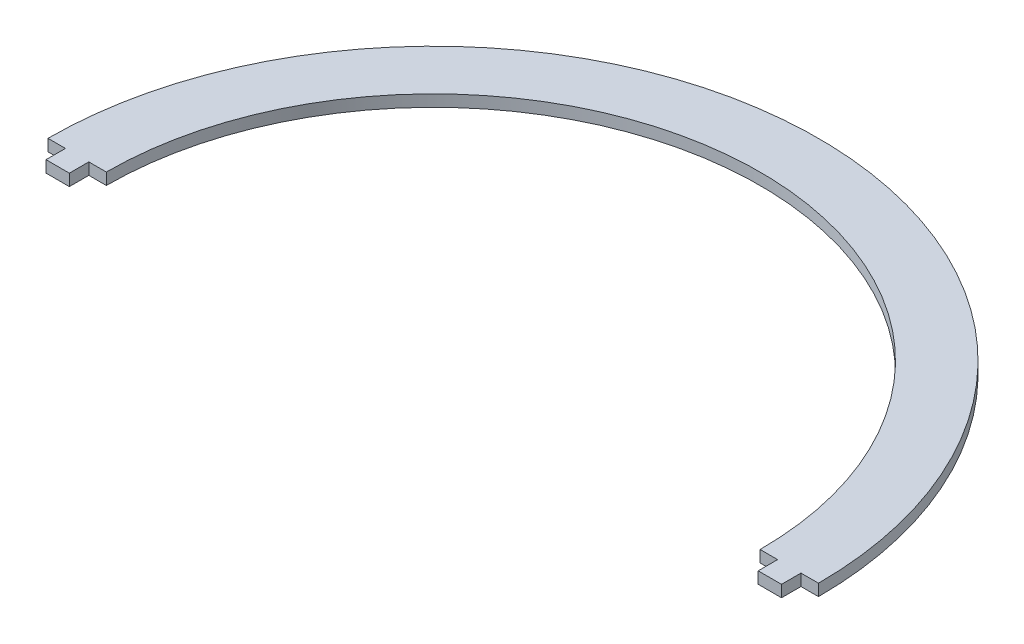
ISO-10303-21;
HEADER;
FILE_DESCRIPTION(('STEP AP214'),'2;1');
FILE_NAME('part.step','',(''),(''),'','','');
FILE_SCHEMA(('AUTOMOTIVE_DESIGN { 1 0 10303 214 1 1 1 1 }'));
ENDSEC;
DATA;
#1=APPLICATION_CONTEXT('core data for automotive mechanical design processes');
#2=APPLICATION_PROTOCOL_DEFINITION('international standard','automotive_design',2000,#1);
#3=PRODUCT_CONTEXT('',#1,'mechanical');
#4=PRODUCT('Part','Part','',(#3));
#5=PRODUCT_RELATED_PRODUCT_CATEGORY('part','',(#4));
#6=PRODUCT_DEFINITION_FORMATION('','',#4);
#7=PRODUCT_DEFINITION_CONTEXT('part definition',#1,'design');
#8=PRODUCT_DEFINITION('design','',#6,#7);
#9=PRODUCT_DEFINITION_SHAPE('','',#8);
#10=(LENGTH_UNIT() NAMED_UNIT(*) SI_UNIT(.MILLI.,.METRE.));
#11=(NAMED_UNIT(*) PLANE_ANGLE_UNIT() SI_UNIT($,.RADIAN.));
#12=(NAMED_UNIT(*) SI_UNIT($,.STERADIAN.) SOLID_ANGLE_UNIT());
#13=UNCERTAINTY_MEASURE_WITH_UNIT(LENGTH_MEASURE(1.E-05),#10,'distance_accuracy_value','');
#14=(GEOMETRIC_REPRESENTATION_CONTEXT(3) GLOBAL_UNCERTAINTY_ASSIGNED_CONTEXT((#13)) GLOBAL_UNIT_ASSIGNED_CONTEXT((#10,
#11,#12)) REPRESENTATION_CONTEXT('',''));
#15=CARTESIAN_POINT('',(0.,0.,0.));
#16=DIRECTION('',(0.,0.,1.));
#17=DIRECTION('',(1.,0.,0.));
#18=AXIS2_PLACEMENT_3D('',#15,#16,#17);
#19=CARTESIAN_POINT('',(-94.5,1.5,-5.));
#20=DIRECTION('',(1.,0.,0.));
#21=DIRECTION('',(0.,0.,-1.));
#22=AXIS2_PLACEMENT_3D('',#19,#20,#21);
#23=PLANE('',#22);
#24=DIRECTION('',(0.,0.,1.));
#25=VECTOR('',#24,1.);
#26=CARTESIAN_POINT('',(-94.5,-1.5,-5.));
#27=LINE('',#26,#25);
#28=CARTESIAN_POINT('',(-94.5,-1.5,-5.));
#29=VERTEX_POINT('',#28);
#30=CARTESIAN_POINT('',(-94.5,-1.5,0.));
#31=VERTEX_POINT('',#30);
#32=EDGE_CURVE('E154',#29,#31,#27,.T.);
#33=ORIENTED_EDGE('',*,*,#32,.T.);
#34=DIRECTION('',(0.,-1.,0.));
#35=VECTOR('',#34,1.);
#36=CARTESIAN_POINT('',(-94.5,1.5,0.));
#37=LINE('',#36,#35);
#38=CARTESIAN_POINT('',(-94.5,1.5,0.));
#39=VERTEX_POINT('',#38);
#40=EDGE_CURVE('E11',#39,#31,#37,.T.);
#41=ORIENTED_EDGE('',*,*,#40,.F.);
#42=DIRECTION('',(0.,0.,1.));
#43=VECTOR('',#42,1.);
#44=CARTESIAN_POINT('',(-94.5,1.5,-5.));
#45=LINE('',#44,#43);
#46=CARTESIAN_POINT('',(-94.5,1.5,-5.));
#47=VERTEX_POINT('',#46);
#48=EDGE_CURVE('E176',#47,#39,#45,.T.);
#49=ORIENTED_EDGE('',*,*,#48,.F.);
#50=DIRECTION('',(0.,-1.,0.));
#51=VECTOR('',#50,1.);
#52=CARTESIAN_POINT('',(-94.5,1.5,-5.));
#53=LINE('',#52,#51);
#54=EDGE_CURVE('E150',#47,#29,#53,.T.);
#55=ORIENTED_EDGE('',*,*,#54,.T.);
#56=EDGE_LOOP('',(#33,#41,#49,#55));
#57=FACE_BOUND('',#56,.T.);
#58=ADVANCED_FACE('F34',(#57),#23,.F.);
#59=CARTESIAN_POINT('',(-94.5,1.5,0.));
#60=DIRECTION('',(0.,0.,-1.));
#61=DIRECTION('',(-1.,0.,0.));
#62=AXIS2_PLACEMENT_3D('',#59,#60,#61);
#63=PLANE('',#62);
#64=DIRECTION('',(1.,0.,0.));
#65=VECTOR('',#64,1.);
#66=CARTESIAN_POINT('',(-94.5,-1.5,0.));
#67=LINE('',#66,#65);
#68=CARTESIAN_POINT('',(-88.5,-1.5,0.));
#69=VERTEX_POINT('',#68);
#70=EDGE_CURVE('E157',#31,#69,#67,.T.);
#71=ORIENTED_EDGE('',*,*,#70,.T.);
#72=DIRECTION('',(0.,-1.,0.));
#73=VECTOR('',#72,1.);
#74=CARTESIAN_POINT('',(-88.5,1.5,0.));
#75=LINE('',#74,#73);
#76=CARTESIAN_POINT('',(-88.5,1.5,0.));
#77=VERTEX_POINT('',#76);
#78=EDGE_CURVE('E42',#77,#69,#75,.T.);
#79=ORIENTED_EDGE('',*,*,#78,.F.);
#80=DIRECTION('',(1.,0.,0.));
#81=VECTOR('',#80,1.);
#82=CARTESIAN_POINT('',(-94.5,1.5,0.));
#83=LINE('',#82,#81);
#84=EDGE_CURVE('E105',#39,#77,#83,.T.);
#85=ORIENTED_EDGE('',*,*,#84,.F.);
#86=ORIENTED_EDGE('',*,*,#40,.T.);
#87=EDGE_LOOP('',(#71,#79,#85,#86));
#88=FACE_BOUND('',#87,.T.);
#89=ADVANCED_FACE('F254',(#88),#63,.F.);
#90=CARTESIAN_POINT('',(-88.5,1.5,0.));
#91=DIRECTION('',(-1.,0.,0.));
#92=DIRECTION('',(0.,0.,1.));
#93=AXIS2_PLACEMENT_3D('',#90,#91,#92);
#94=PLANE('',#93);
#95=DIRECTION('',(0.,0.,-1.));
#96=VECTOR('',#95,1.);
#97=CARTESIAN_POINT('',(-88.5,-1.5,0.));
#98=LINE('',#97,#96);
#99=CARTESIAN_POINT('',(-88.5,-1.5,-5.));
#100=VERTEX_POINT('',#99);
#101=EDGE_CURVE('E159',#69,#100,#98,.T.);
#102=ORIENTED_EDGE('',*,*,#101,.T.);
#103=DIRECTION('',(0.,-1.,0.));
#104=VECTOR('',#103,1.);
#105=CARTESIAN_POINT('',(-88.5,1.5,-5.));
#106=LINE('',#105,#104);
#107=CARTESIAN_POINT('',(-88.5,1.5,-5.));
#108=VERTEX_POINT('',#107);
#109=EDGE_CURVE('E195',#108,#100,#106,.T.);
#110=ORIENTED_EDGE('',*,*,#109,.F.);
#111=DIRECTION('',(0.,0.,-1.));
#112=VECTOR('',#111,1.);
#113=CARTESIAN_POINT('',(-88.5,1.5,0.));
#114=LINE('',#113,#112);
#115=EDGE_CURVE('E203',#77,#108,#114,.T.);
#116=ORIENTED_EDGE('',*,*,#115,.F.);
#117=ORIENTED_EDGE('',*,*,#78,.T.);
#118=EDGE_LOOP('',(#102,#110,#116,#117));
#119=FACE_BOUND('',#118,.T.);
#120=ADVANCED_FACE('F201',(#119),#94,.F.);
#121=CARTESIAN_POINT('',(-88.5,1.5,-5.));
#122=DIRECTION('',(0.,0.,-1.));
#123=DIRECTION('',(-1.,0.,0.));
#124=AXIS2_PLACEMENT_3D('',#121,#122,#123);
#125=PLANE('',#124);
#126=DIRECTION('',(1.,0.,0.));
#127=VECTOR('',#126,1.);
#128=CARTESIAN_POINT('',(-88.5,-1.5,-5.));
#129=LINE('',#128,#127);
#130=CARTESIAN_POINT('',(-84.,-1.5,-5.));
#131=VERTEX_POINT('',#130);
#132=EDGE_CURVE('E161',#100,#131,#129,.T.);
#133=ORIENTED_EDGE('',*,*,#132,.T.);
#134=DIRECTION('',(0.,-1.,0.));
#135=VECTOR('',#134,1.);
#136=CARTESIAN_POINT('',(-84.,1.5,-5.));
#137=LINE('',#136,#135);
#138=CARTESIAN_POINT('',(-84.,1.5,-5.));
#139=VERTEX_POINT('',#138);
#140=EDGE_CURVE('E192',#139,#131,#137,.T.);
#141=ORIENTED_EDGE('',*,*,#140,.F.);
#142=DIRECTION('',(1.,0.,0.));
#143=VECTOR('',#142,1.);
#144=CARTESIAN_POINT('',(-88.5,1.5,-5.));
#145=LINE('',#144,#143);
#146=EDGE_CURVE('E221',#108,#139,#145,.T.);
#147=ORIENTED_EDGE('',*,*,#146,.F.);
#148=ORIENTED_EDGE('',*,*,#109,.T.);
#149=EDGE_LOOP('',(#133,#141,#147,#148));
#150=FACE_BOUND('',#149,.T.);
#151=ADVANCED_FACE('F212',(#150),#125,.F.);
#152=CARTESIAN_POINT('',(0.,1.5,-5.));
#153=DIRECTION('',(0.,-1.,0.));
#154=DIRECTION('',(0.,0.,-1.));
#155=AXIS2_PLACEMENT_3D('',#152,#153,#154);
#156=CYLINDRICAL_SURFACE('',#155,84.);
#157=CARTESIAN_POINT('',(0.,-1.5,-5.));
#158=DIRECTION('',(0.,-1.,0.));
#159=DIRECTION('',(0.,0.,-1.));
#160=AXIS2_PLACEMENT_3D('',#157,#158,#159);
#161=CIRCLE('',#160,84.);
#162=CARTESIAN_POINT('',(84.,-1.5,-5.00000000000001));
#163=VERTEX_POINT('',#162);
#164=EDGE_CURVE('E163',#131,#163,#161,.T.);
#165=ORIENTED_EDGE('',*,*,#164,.T.);
#166=DIRECTION('',(0.,-1.,0.));
#167=VECTOR('',#166,1.);
#168=CARTESIAN_POINT('',(84.,1.5,-5.00000000000001));
#169=LINE('',#168,#167);
#170=CARTESIAN_POINT('',(84.,1.5,-5.00000000000001));
#171=VERTEX_POINT('',#170);
#172=EDGE_CURVE('E189',#171,#163,#169,.T.);
#173=ORIENTED_EDGE('',*,*,#172,.F.);
#174=CARTESIAN_POINT('',(0.,1.5,-5.));
#175=DIRECTION('',(0.,-1.,0.));
#176=DIRECTION('',(0.,0.,-1.));
#177=AXIS2_PLACEMENT_3D('',#174,#175,#176);
#178=CIRCLE('',#177,84.);
#179=EDGE_CURVE('E218',#139,#171,#178,.T.);
#180=ORIENTED_EDGE('',*,*,#179,.F.);
#181=ORIENTED_EDGE('',*,*,#140,.T.);
#182=EDGE_LOOP('',(#165,#173,#180,#181));
#183=FACE_BOUND('',#182,.T.);
#184=ADVANCED_FACE('F216',(#183),#156,.F.);
#185=CARTESIAN_POINT('',(84.,1.5,-5.));
#186=DIRECTION('',(0.,0.,-1.));
#187=DIRECTION('',(-1.,0.,0.));
#188=AXIS2_PLACEMENT_3D('',#185,#186,#187);
#189=PLANE('',#188);
#190=DIRECTION('',(1.,0.,0.));
#191=VECTOR('',#190,1.);
#192=CARTESIAN_POINT('',(84.,-1.5,-5.));
#193=LINE('',#192,#191);
#194=CARTESIAN_POINT('',(88.5,-1.5,-5.));
#195=VERTEX_POINT('',#194);
#196=EDGE_CURVE('E165',#163,#195,#193,.T.);
#197=ORIENTED_EDGE('',*,*,#196,.T.);
#198=DIRECTION('',(0.,-1.,0.));
#199=VECTOR('',#198,1.);
#200=CARTESIAN_POINT('',(88.5,1.5,-5.));
#201=LINE('',#200,#199);
#202=CARTESIAN_POINT('',(88.5,1.5,-5.));
#203=VERTEX_POINT('',#202);
#204=EDGE_CURVE('E186',#203,#195,#201,.T.);
#205=ORIENTED_EDGE('',*,*,#204,.F.);
#206=DIRECTION('',(1.,0.,0.));
#207=VECTOR('',#206,1.);
#208=CARTESIAN_POINT('',(84.,1.5,-5.));
#209=LINE('',#208,#207);
#210=EDGE_CURVE('E220',#171,#203,#209,.T.);
#211=ORIENTED_EDGE('',*,*,#210,.F.);
#212=ORIENTED_EDGE('',*,*,#172,.T.);
#213=EDGE_LOOP('',(#197,#205,#211,#212));
#214=FACE_BOUND('',#213,.T.);
#215=ADVANCED_FACE('F267',(#214),#189,.F.);
#216=CARTESIAN_POINT('',(88.5,1.5,-5.));
#217=DIRECTION('',(1.,0.,0.));
#218=DIRECTION('',(0.,0.,-1.));
#219=AXIS2_PLACEMENT_3D('',#216,#217,#218);
#220=PLANE('',#219);
#221=DIRECTION('',(0.,0.,1.));
#222=VECTOR('',#221,1.);
#223=CARTESIAN_POINT('',(88.5,-1.5,-5.));
#224=LINE('',#223,#222);
#225=CARTESIAN_POINT('',(88.5,-1.5,0.));
#226=VERTEX_POINT('',#225);
#227=EDGE_CURVE('E167',#195,#226,#224,.T.);
#228=ORIENTED_EDGE('',*,*,#227,.T.);
#229=DIRECTION('',(0.,-1.,0.));
#230=VECTOR('',#229,1.);
#231=CARTESIAN_POINT('',(88.5,1.5,0.));
#232=LINE('',#231,#230);
#233=CARTESIAN_POINT('',(88.5,1.5,0.));
#234=VERTEX_POINT('',#233);
#235=EDGE_CURVE('E183',#234,#226,#232,.T.);
#236=ORIENTED_EDGE('',*,*,#235,.F.);
#237=DIRECTION('',(0.,0.,1.));
#238=VECTOR('',#237,1.);
#239=CARTESIAN_POINT('',(88.5,1.5,-5.));
#240=LINE('',#239,#238);
#241=EDGE_CURVE('E223',#203,#234,#240,.T.);
#242=ORIENTED_EDGE('',*,*,#241,.F.);
#243=ORIENTED_EDGE('',*,*,#204,.T.);
#244=EDGE_LOOP('',(#228,#236,#242,#243));
#245=FACE_BOUND('',#244,.T.);
#246=ADVANCED_FACE('F270',(#245),#220,.F.);
#247=CARTESIAN_POINT('',(88.5,1.5,0.));
#248=DIRECTION('',(0.,0.,-1.));
#249=DIRECTION('',(-1.,0.,0.));
#250=AXIS2_PLACEMENT_3D('',#247,#248,#249);
#251=PLANE('',#250);
#252=DIRECTION('',(1.,0.,0.));
#253=VECTOR('',#252,1.);
#254=CARTESIAN_POINT('',(88.5,-1.5,0.));
#255=LINE('',#254,#253);
#256=CARTESIAN_POINT('',(94.5,-1.5,0.));
#257=VERTEX_POINT('',#256);
#258=EDGE_CURVE('E169',#226,#257,#255,.T.);
#259=ORIENTED_EDGE('',*,*,#258,.T.);
#260=DIRECTION('',(0.,-1.,0.));
#261=VECTOR('',#260,1.);
#262=CARTESIAN_POINT('',(94.5,1.5,0.));
#263=LINE('',#262,#261);
#264=CARTESIAN_POINT('',(94.5,1.5,0.));
#265=VERTEX_POINT('',#264);
#266=EDGE_CURVE('E180',#265,#257,#263,.T.);
#267=ORIENTED_EDGE('',*,*,#266,.F.);
#268=DIRECTION('',(1.,0.,0.));
#269=VECTOR('',#268,1.);
#270=CARTESIAN_POINT('',(88.5,1.5,0.));
#271=LINE('',#270,#269);
#272=EDGE_CURVE('E229',#234,#265,#271,.T.);
#273=ORIENTED_EDGE('',*,*,#272,.F.);
#274=ORIENTED_EDGE('',*,*,#235,.T.);
#275=EDGE_LOOP('',(#259,#267,#273,#274));
#276=FACE_BOUND('',#275,.T.);
#277=ADVANCED_FACE('F235',(#276),#251,.F.);
#278=CARTESIAN_POINT('',(94.5,1.5,0.));
#279=DIRECTION('',(-1.,0.,0.));
#280=DIRECTION('',(0.,0.,1.));
#281=AXIS2_PLACEMENT_3D('',#278,#279,#280);
#282=PLANE('',#281);
#283=DIRECTION('',(0.,0.,-1.));
#284=VECTOR('',#283,1.);
#285=CARTESIAN_POINT('',(94.5,-1.5,0.));
#286=LINE('',#285,#284);
#287=CARTESIAN_POINT('',(94.5,-1.5,-5.));
#288=VERTEX_POINT('',#287);
#289=EDGE_CURVE('E171',#257,#288,#286,.T.);
#290=ORIENTED_EDGE('',*,*,#289,.T.);
#291=DIRECTION('',(0.,-1.,0.));
#292=VECTOR('',#291,1.);
#293=CARTESIAN_POINT('',(94.5,1.5,-5.));
#294=LINE('',#293,#292);
#295=CARTESIAN_POINT('',(94.5,1.5,-5.));
#296=VERTEX_POINT('',#295);
#297=EDGE_CURVE('E145',#296,#288,#294,.T.);
#298=ORIENTED_EDGE('',*,*,#297,.F.);
#299=DIRECTION('',(0.,0.,-1.));
#300=VECTOR('',#299,1.);
#301=CARTESIAN_POINT('',(94.5,1.5,0.));
#302=LINE('',#301,#300);
#303=EDGE_CURVE('E136',#265,#296,#302,.T.);
#304=ORIENTED_EDGE('',*,*,#303,.F.);
#305=ORIENTED_EDGE('',*,*,#266,.T.);
#306=EDGE_LOOP('',(#290,#298,#304,#305));
#307=FACE_BOUND('',#306,.T.);
#308=ADVANCED_FACE('F239',(#307),#282,.F.);
#309=CARTESIAN_POINT('',(94.5,1.5,-5.));
#310=DIRECTION('',(0.,0.,-1.));
#311=DIRECTION('',(-1.,0.,0.));
#312=AXIS2_PLACEMENT_3D('',#309,#310,#311);
#313=PLANE('',#312);
#314=DIRECTION('',(1.,0.,0.));
#315=VECTOR('',#314,1.);
#316=CARTESIAN_POINT('',(94.5,-1.5,-5.));
#317=LINE('',#316,#315);
#318=CARTESIAN_POINT('',(99.,-1.5,-5.));
#319=VERTEX_POINT('',#318);
#320=EDGE_CURVE('E144',#288,#319,#317,.T.);
#321=ORIENTED_EDGE('',*,*,#320,.T.);
#322=DIRECTION('',(0.,-1.,0.));
#323=VECTOR('',#322,1.);
#324=CARTESIAN_POINT('',(99.,1.5,-5.));
#325=LINE('',#324,#323);
#326=CARTESIAN_POINT('',(99.,1.5,-5.));
#327=VERTEX_POINT('',#326);
#328=EDGE_CURVE('E141',#327,#319,#325,.T.);
#329=ORIENTED_EDGE('',*,*,#328,.F.);
#330=DIRECTION('',(1.,0.,0.));
#331=VECTOR('',#330,1.);
#332=CARTESIAN_POINT('',(94.5,1.5,-5.));
#333=LINE('',#332,#331);
#334=EDGE_CURVE('E130',#296,#327,#333,.T.);
#335=ORIENTED_EDGE('',*,*,#334,.F.);
#336=ORIENTED_EDGE('',*,*,#297,.T.);
#337=EDGE_LOOP('',(#321,#329,#335,#336));
#338=FACE_BOUND('',#337,.T.);
#339=ADVANCED_FACE('F142',(#338),#313,.F.);
#340=CARTESIAN_POINT('',(0.,1.5,-5.));
#341=DIRECTION('',(0.,-1.,0.));
#342=DIRECTION('',(0.,0.,-1.));
#343=AXIS2_PLACEMENT_3D('',#340,#341,#342);
#344=CYLINDRICAL_SURFACE('',#343,99.);
#345=CARTESIAN_POINT('',(0.,-1.5,-5.));
#346=DIRECTION('',(0.,1.,0.));
#347=DIRECTION('',(0.,0.,1.));
#348=AXIS2_PLACEMENT_3D('',#345,#346,#347);
#349=CIRCLE('',#348,99.);
#350=CARTESIAN_POINT('',(-99.,-1.5,-5.00000000000002));
#351=VERTEX_POINT('',#350);
#352=EDGE_CURVE('E91',#319,#351,#349,.T.);
#353=ORIENTED_EDGE('',*,*,#352,.T.);
#354=DIRECTION('',(0.,-1.,0.));
#355=VECTOR('',#354,1.);
#356=CARTESIAN_POINT('',(-99.,1.5,-5.00000000000002));
#357=LINE('',#356,#355);
#358=CARTESIAN_POINT('',(-99.,1.5,-5.00000000000002));
#359=VERTEX_POINT('',#358);
#360=EDGE_CURVE('E146',#359,#351,#357,.T.);
#361=ORIENTED_EDGE('',*,*,#360,.F.);
#362=CARTESIAN_POINT('',(0.,1.5,-5.));
#363=DIRECTION('',(0.,1.,0.));
#364=DIRECTION('',(0.,0.,1.));
#365=AXIS2_PLACEMENT_3D('',#362,#363,#364);
#366=CIRCLE('',#365,99.);
#367=EDGE_CURVE('E134',#327,#359,#366,.T.);
#368=ORIENTED_EDGE('',*,*,#367,.F.);
#369=ORIENTED_EDGE('',*,*,#328,.T.);
#370=EDGE_LOOP('',(#353,#361,#368,#369));
#371=FACE_BOUND('',#370,.T.);
#372=ADVANCED_FACE('F148',(#371),#344,.T.);
#373=CARTESIAN_POINT('',(-99.,1.5,-5.));
#374=DIRECTION('',(0.,0.,-1.));
#375=DIRECTION('',(-1.,0.,0.));
#376=AXIS2_PLACEMENT_3D('',#373,#374,#375);
#377=PLANE('',#376);
#378=DIRECTION('',(1.,0.,0.));
#379=VECTOR('',#378,1.);
#380=CARTESIAN_POINT('',(-99.,-1.5,-5.));
#381=LINE('',#380,#379);
#382=EDGE_CURVE('E97',#351,#29,#381,.T.);
#383=ORIENTED_EDGE('',*,*,#382,.T.);
#384=ORIENTED_EDGE('',*,*,#54,.F.);
#385=DIRECTION('',(1.,0.,0.));
#386=VECTOR('',#385,1.);
#387=CARTESIAN_POINT('',(-99.,1.5,-5.));
#388=LINE('',#387,#386);
#389=EDGE_CURVE('E50',#359,#47,#388,.T.);
#390=ORIENTED_EDGE('',*,*,#389,.F.);
#391=ORIENTED_EDGE('',*,*,#360,.T.);
#392=EDGE_LOOP('',(#383,#384,#390,#391));
#393=FACE_BOUND('',#392,.T.);
#394=ADVANCED_FACE('F243',(#393),#377,.F.);
#395=CARTESIAN_POINT('',(0.,1.5,-5.));
#396=DIRECTION('',(0.,-1.,0.));
#397=DIRECTION('',(0.,0.,-1.));
#398=AXIS2_PLACEMENT_3D('',#395,#396,#397);
#399=PLANE('',#398);
#400=ORIENTED_EDGE('',*,*,#48,.T.);
#401=ORIENTED_EDGE('',*,*,#84,.T.);
#402=ORIENTED_EDGE('',*,*,#115,.T.);
#403=ORIENTED_EDGE('',*,*,#146,.T.);
#404=ORIENTED_EDGE('',*,*,#179,.T.);
#405=ORIENTED_EDGE('',*,*,#210,.T.);
#406=ORIENTED_EDGE('',*,*,#241,.T.);
#407=ORIENTED_EDGE('',*,*,#272,.T.);
#408=ORIENTED_EDGE('',*,*,#303,.T.);
#409=ORIENTED_EDGE('',*,*,#334,.T.);
#410=ORIENTED_EDGE('',*,*,#367,.T.);
#411=ORIENTED_EDGE('',*,*,#389,.T.);
#412=EDGE_LOOP('',(#400,#401,#402,#403,#404,#405,#406,#407,#408,#409,#410,#411));
#413=FACE_BOUND('',#412,.T.);
#414=ADVANCED_FACE('F132',(#413),#399,.F.);
#415=CARTESIAN_POINT('',(0.,-1.5,-5.));
#416=DIRECTION('',(0.,-1.,0.));
#417=DIRECTION('',(0.,0.,-1.));
#418=AXIS2_PLACEMENT_3D('',#415,#416,#417);
#419=PLANE('',#418);
#420=ORIENTED_EDGE('',*,*,#32,.F.);
#421=ORIENTED_EDGE('',*,*,#382,.F.);
#422=ORIENTED_EDGE('',*,*,#352,.F.);
#423=ORIENTED_EDGE('',*,*,#320,.F.);
#424=ORIENTED_EDGE('',*,*,#289,.F.);
#425=ORIENTED_EDGE('',*,*,#258,.F.);
#426=ORIENTED_EDGE('',*,*,#227,.F.);
#427=ORIENTED_EDGE('',*,*,#196,.F.);
#428=ORIENTED_EDGE('',*,*,#164,.F.);
#429=ORIENTED_EDGE('',*,*,#132,.F.);
#430=ORIENTED_EDGE('',*,*,#101,.F.);
#431=ORIENTED_EDGE('',*,*,#70,.F.);
#432=EDGE_LOOP('',(#420,#421,#422,#423,#424,#425,#426,#427,#428,#429,#430,#431));
#433=FACE_BOUND('',#432,.T.);
#434=ADVANCED_FACE('F207',(#433),#419,.T.);
#435=CLOSED_SHELL('',(#58,#89,#120,#151,#184,#215,#246,#277,#308,#339,#372,#394,#414,#434));
#436=MANIFOLD_SOLID_BREP('B2',#435);
#437=ADVANCED_BREP_SHAPE_REPRESENTATION('',(#18,#436),#14);
#438=SHAPE_DEFINITION_REPRESENTATION(#9,#437);
ENDSEC;
END-ISO-10303-21;
